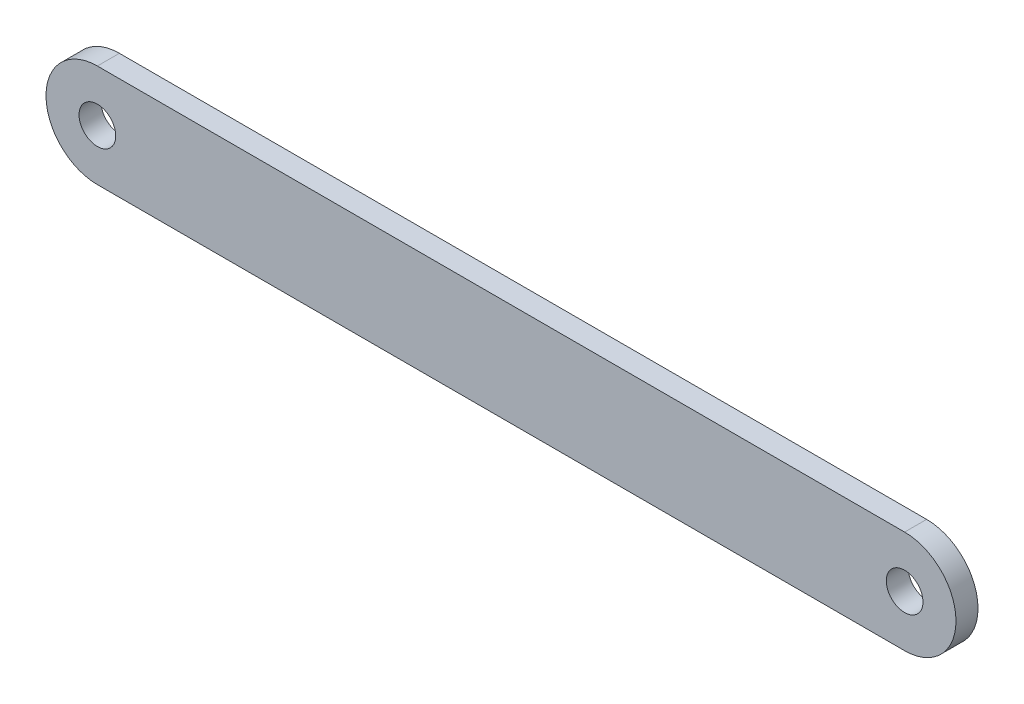
ISO-10303-21;
HEADER;
FILE_DESCRIPTION(('STEP AP214'),'2;1');
FILE_NAME('part.step','',(''),(''),'','','');
FILE_SCHEMA(('AUTOMOTIVE_DESIGN { 1 0 10303 214 1 1 1 1 }'));
ENDSEC;
DATA;
#1=APPLICATION_CONTEXT('core data for automotive mechanical design processes');
#2=APPLICATION_PROTOCOL_DEFINITION('international standard','automotive_design',2000,#1);
#3=PRODUCT_CONTEXT('',#1,'mechanical');
#4=PRODUCT('Part','Part','',(#3));
#5=PRODUCT_RELATED_PRODUCT_CATEGORY('part','',(#4));
#6=PRODUCT_DEFINITION_FORMATION('','',#4);
#7=PRODUCT_DEFINITION_CONTEXT('part definition',#1,'design');
#8=PRODUCT_DEFINITION('design','',#6,#7);
#9=PRODUCT_DEFINITION_SHAPE('','',#8);
#10=(LENGTH_UNIT() NAMED_UNIT(*) SI_UNIT(.MILLI.,.METRE.));
#11=(NAMED_UNIT(*) PLANE_ANGLE_UNIT() SI_UNIT($,.RADIAN.));
#12=(NAMED_UNIT(*) SI_UNIT($,.STERADIAN.) SOLID_ANGLE_UNIT());
#13=UNCERTAINTY_MEASURE_WITH_UNIT(LENGTH_MEASURE(1.E-05),#10,'distance_accuracy_value','');
#14=(GEOMETRIC_REPRESENTATION_CONTEXT(3) GLOBAL_UNCERTAINTY_ASSIGNED_CONTEXT((#13)) GLOBAL_UNIT_ASSIGNED_CONTEXT((#10,
#11,#12)) REPRESENTATION_CONTEXT('',''));
#15=CARTESIAN_POINT('',(0.,0.,0.));
#16=DIRECTION('',(0.,0.,1.));
#17=DIRECTION('',(1.,0.,0.));
#18=AXIS2_PLACEMENT_3D('',#15,#16,#17);
#19=CARTESIAN_POINT('',(-70.9590092991141,262.154117688394,3.));
#20=DIRECTION('',(0.,0.,1.));
#21=DIRECTION('',(1.,0.,0.));
#22=AXIS2_PLACEMENT_3D('',#19,#20,#21);
#23=PLANE('',#22);
#24=CARTESIAN_POINT('',(-70.9590092991141,262.154117688394,3.));
#25=DIRECTION('',(0.,0.,1.));
#26=DIRECTION('',(1.,0.,0.));
#27=AXIS2_PLACEMENT_3D('',#24,#25,#26);
#28=CIRCLE('',#27,2.5);
#29=CARTESIAN_POINT('',(-68.4590092991141,262.154117688394,3.));
#30=VERTEX_POINT('',#29);
#31=EDGE_CURVE('E102',#30,#30,#28,.T.);
#32=ORIENTED_EDGE('',*,*,#31,.F.);
#33=EDGE_LOOP('',(#32));
#34=FACE_BOUND('',#33,.T.);
#35=CARTESIAN_POINT('',(-70.9590092991141,262.154117688394,3.));
#36=DIRECTION('',(0.,0.,1.));
#37=DIRECTION('',(1.,0.,0.));
#38=AXIS2_PLACEMENT_3D('',#35,#36,#37);
#39=CIRCLE('',#38,7.00000000000001);
#40=CARTESIAN_POINT('',(-70.9590092991141,269.154117688394,3.));
#41=VERTEX_POINT('',#40);
#42=CARTESIAN_POINT('',(-70.9590092991141,255.154117688394,3.));
#43=VERTEX_POINT('',#42);
#44=EDGE_CURVE('E87',#41,#43,#39,.T.);
#45=ORIENTED_EDGE('',*,*,#44,.T.);
#46=DIRECTION('',(1.,0.,0.));
#47=VECTOR('',#46,1.);
#48=CARTESIAN_POINT('',(39.0409907008859,255.154117688394,3.));
#49=LINE('',#48,#47);
#50=CARTESIAN_POINT('',(39.0409907008859,255.154117688394,3.));
#51=VERTEX_POINT('',#50);
#52=EDGE_CURVE('E82',#43,#51,#49,.T.);
#53=ORIENTED_EDGE('',*,*,#52,.T.);
#54=CARTESIAN_POINT('',(39.0409907008859,262.154117688394,3.));
#55=DIRECTION('',(0.,0.,1.));
#56=DIRECTION('',(1.,0.,0.));
#57=AXIS2_PLACEMENT_3D('',#54,#55,#56);
#58=CIRCLE('',#57,7.00000000000001);
#59=CARTESIAN_POINT('',(39.0409907008859,269.154117688394,3.));
#60=VERTEX_POINT('',#59);
#61=EDGE_CURVE('E85',#51,#60,#58,.T.);
#62=ORIENTED_EDGE('',*,*,#61,.T.);
#63=DIRECTION('',(-1.,0.,0.));
#64=VECTOR('',#63,1.);
#65=CARTESIAN_POINT('',(-70.9590092991141,269.154117688394,3.));
#66=LINE('',#65,#64);
#67=EDGE_CURVE('E52',#60,#41,#66,.T.);
#68=ORIENTED_EDGE('',*,*,#67,.T.);
#69=EDGE_LOOP('',(#45,#53,#62,#68));
#70=FACE_BOUND('',#69,.T.);
#71=CARTESIAN_POINT('',(39.0409907008859,262.154117688394,3.));
#72=DIRECTION('',(0.,0.,1.));
#73=DIRECTION('',(1.,0.,0.));
#74=AXIS2_PLACEMENT_3D('',#71,#72,#73);
#75=CIRCLE('',#74,2.5);
#76=CARTESIAN_POINT('',(41.5409907008859,262.154117688394,3.));
#77=VERTEX_POINT('',#76);
#78=EDGE_CURVE('E117',#77,#77,#75,.T.);
#79=ORIENTED_EDGE('',*,*,#78,.F.);
#80=EDGE_LOOP('',(#79));
#81=FACE_BOUND('',#80,.T.);
#82=ADVANCED_FACE('F35',(#34,#70,#81),#23,.T.);
#83=CARTESIAN_POINT('',(-70.9590092991141,262.154117688394,0.));
#84=DIRECTION('',(0.,0.,1.));
#85=DIRECTION('',(1.,0.,0.));
#86=AXIS2_PLACEMENT_3D('',#83,#84,#85);
#87=PLANE('',#86);
#88=CARTESIAN_POINT('',(-70.9590092991141,262.154117688394,0.));
#89=DIRECTION('',(0.,0.,1.));
#90=DIRECTION('',(1.,0.,0.));
#91=AXIS2_PLACEMENT_3D('',#88,#89,#90);
#92=CIRCLE('',#91,7.00000000000001);
#93=CARTESIAN_POINT('',(-70.9590092991141,269.154117688394,0.));
#94=VERTEX_POINT('',#93);
#95=CARTESIAN_POINT('',(-70.9590092991141,255.154117688394,0.));
#96=VERTEX_POINT('',#95);
#97=EDGE_CURVE('E99',#94,#96,#92,.T.);
#98=ORIENTED_EDGE('',*,*,#97,.F.);
#99=DIRECTION('',(-1.,0.,0.));
#100=VECTOR('',#99,1.);
#101=CARTESIAN_POINT('',(-70.9590092991141,269.154117688394,0.));
#102=LINE('',#101,#100);
#103=CARTESIAN_POINT('',(39.0409907008859,269.154117688394,0.));
#104=VERTEX_POINT('',#103);
#105=EDGE_CURVE('E75',#104,#94,#102,.T.);
#106=ORIENTED_EDGE('',*,*,#105,.F.);
#107=CARTESIAN_POINT('',(39.0409907008859,262.154117688394,0.));
#108=DIRECTION('',(0.,0.,1.));
#109=DIRECTION('',(1.,0.,0.));
#110=AXIS2_PLACEMENT_3D('',#107,#108,#109);
#111=CIRCLE('',#110,7.00000000000001);
#112=CARTESIAN_POINT('',(39.0409907008859,255.154117688394,0.));
#113=VERTEX_POINT('',#112);
#114=EDGE_CURVE('E69',#113,#104,#111,.T.);
#115=ORIENTED_EDGE('',*,*,#114,.F.);
#116=DIRECTION('',(1.,0.,0.));
#117=VECTOR('',#116,1.);
#118=CARTESIAN_POINT('',(39.0409907008859,255.154117688394,0.));
#119=LINE('',#118,#117);
#120=EDGE_CURVE('E91',#96,#113,#119,.T.);
#121=ORIENTED_EDGE('',*,*,#120,.F.);
#122=EDGE_LOOP('',(#98,#106,#115,#121));
#123=FACE_BOUND('',#122,.T.);
#124=CARTESIAN_POINT('',(-70.9590092991141,262.154117688394,0.));
#125=DIRECTION('',(0.,0.,1.));
#126=DIRECTION('',(1.,0.,0.));
#127=AXIS2_PLACEMENT_3D('',#124,#125,#126);
#128=CIRCLE('',#127,2.5);
#129=CARTESIAN_POINT('',(-68.4590092991141,262.154117688394,0.));
#130=VERTEX_POINT('',#129);
#131=EDGE_CURVE('E114',#130,#130,#128,.T.);
#132=ORIENTED_EDGE('',*,*,#131,.T.);
#133=EDGE_LOOP('',(#132));
#134=FACE_BOUND('',#133,.T.);
#135=CARTESIAN_POINT('',(39.0409907008859,262.154117688394,0.));
#136=DIRECTION('',(0.,0.,1.));
#137=DIRECTION('',(1.,0.,0.));
#138=AXIS2_PLACEMENT_3D('',#135,#136,#137);
#139=CIRCLE('',#138,2.5);
#140=CARTESIAN_POINT('',(41.5409907008859,262.154117688394,0.));
#141=VERTEX_POINT('',#140);
#142=EDGE_CURVE('E120',#141,#141,#139,.T.);
#143=ORIENTED_EDGE('',*,*,#142,.T.);
#144=EDGE_LOOP('',(#143));
#145=FACE_BOUND('',#144,.T.);
#146=ADVANCED_FACE('F110',(#123,#134,#145),#87,.F.);
#147=CARTESIAN_POINT('',(-70.9590092991141,262.154117688394,3.));
#148=DIRECTION('',(0.,0.,-1.));
#149=DIRECTION('',(-1.,0.,0.));
#150=AXIS2_PLACEMENT_3D('',#147,#148,#149);
#151=CYLINDRICAL_SURFACE('',#150,7.00000000000001);
#152=ORIENTED_EDGE('',*,*,#97,.T.);
#153=DIRECTION('',(0.,0.,-1.));
#154=VECTOR('',#153,1.);
#155=CARTESIAN_POINT('',(-70.9590092991141,255.154117688394,3.));
#156=LINE('',#155,#154);
#157=EDGE_CURVE('E11',#43,#96,#156,.T.);
#158=ORIENTED_EDGE('',*,*,#157,.F.);
#159=ORIENTED_EDGE('',*,*,#44,.F.);
#160=DIRECTION('',(0.,0.,-1.));
#161=VECTOR('',#160,1.);
#162=CARTESIAN_POINT('',(-70.9590092991141,269.154117688394,3.));
#163=LINE('',#162,#161);
#164=EDGE_CURVE('E95',#41,#94,#163,.T.);
#165=ORIENTED_EDGE('',*,*,#164,.T.);
#166=EDGE_LOOP('',(#152,#158,#159,#165));
#167=FACE_BOUND('',#166,.T.);
#168=ADVANCED_FACE('F37',(#167),#151,.T.);
#169=CARTESIAN_POINT('',(39.0409907008859,255.154117688394,3.));
#170=DIRECTION('',(0.,1.,0.));
#171=DIRECTION('',(0.,0.,1.));
#172=AXIS2_PLACEMENT_3D('',#169,#170,#171);
#173=PLANE('',#172);
#174=ORIENTED_EDGE('',*,*,#120,.T.);
#175=DIRECTION('',(0.,0.,-1.));
#176=VECTOR('',#175,1.);
#177=CARTESIAN_POINT('',(39.0409907008859,255.154117688394,3.));
#178=LINE('',#177,#176);
#179=EDGE_CURVE('E44',#51,#113,#178,.T.);
#180=ORIENTED_EDGE('',*,*,#179,.F.);
#181=ORIENTED_EDGE('',*,*,#52,.F.);
#182=ORIENTED_EDGE('',*,*,#157,.T.);
#183=EDGE_LOOP('',(#174,#180,#181,#182));
#184=FACE_BOUND('',#183,.T.);
#185=ADVANCED_FACE('F90',(#184),#173,.F.);
#186=CARTESIAN_POINT('',(39.0409907008859,262.154117688394,3.));
#187=DIRECTION('',(0.,0.,-1.));
#188=DIRECTION('',(-1.,0.,0.));
#189=AXIS2_PLACEMENT_3D('',#186,#187,#188);
#190=CYLINDRICAL_SURFACE('',#189,7.00000000000001);
#191=ORIENTED_EDGE('',*,*,#114,.T.);
#192=DIRECTION('',(0.,0.,-1.));
#193=VECTOR('',#192,1.);
#194=CARTESIAN_POINT('',(39.0409907008859,269.154117688394,3.));
#195=LINE('',#194,#193);
#196=EDGE_CURVE('E92',#60,#104,#195,.T.);
#197=ORIENTED_EDGE('',*,*,#196,.F.);
#198=ORIENTED_EDGE('',*,*,#61,.F.);
#199=ORIENTED_EDGE('',*,*,#179,.T.);
#200=EDGE_LOOP('',(#191,#197,#198,#199));
#201=FACE_BOUND('',#200,.T.);
#202=ADVANCED_FACE('F93',(#201),#190,.T.);
#203=CARTESIAN_POINT('',(-70.9590092991141,269.154117688394,3.));
#204=DIRECTION('',(0.,-1.,0.));
#205=DIRECTION('',(0.,0.,-1.));
#206=AXIS2_PLACEMENT_3D('',#203,#204,#205);
#207=PLANE('',#206);
#208=ORIENTED_EDGE('',*,*,#105,.T.);
#209=ORIENTED_EDGE('',*,*,#164,.F.);
#210=ORIENTED_EDGE('',*,*,#67,.F.);
#211=ORIENTED_EDGE('',*,*,#196,.T.);
#212=EDGE_LOOP('',(#208,#209,#210,#211));
#213=FACE_BOUND('',#212,.T.);
#214=ADVANCED_FACE('F107',(#213),#207,.F.);
#215=CARTESIAN_POINT('',(-70.9590092991141,262.154117688394,3.));
#216=DIRECTION('',(0.,0.,-1.));
#217=DIRECTION('',(-1.,0.,0.));
#218=AXIS2_PLACEMENT_3D('',#215,#216,#217);
#219=CYLINDRICAL_SURFACE('',#218,2.5);
#220=ORIENTED_EDGE('',*,*,#31,.T.);
#221=EDGE_LOOP('',(#220));
#222=FACE_BOUND('',#221,.T.);
#223=ORIENTED_EDGE('',*,*,#131,.F.);
#224=EDGE_LOOP('',(#223));
#225=FACE_BOUND('',#224,.T.);
#226=ADVANCED_FACE('F137',(#222,#225),#219,.F.);
#227=CARTESIAN_POINT('',(39.0409907008859,262.154117688394,3.));
#228=DIRECTION('',(0.,0.,-1.));
#229=DIRECTION('',(-1.,0.,0.));
#230=AXIS2_PLACEMENT_3D('',#227,#228,#229);
#231=CYLINDRICAL_SURFACE('',#230,2.5);
#232=ORIENTED_EDGE('',*,*,#78,.T.);
#233=EDGE_LOOP('',(#232));
#234=FACE_BOUND('',#233,.T.);
#235=ORIENTED_EDGE('',*,*,#142,.F.);
#236=EDGE_LOOP('',(#235));
#237=FACE_BOUND('',#236,.T.);
#238=ADVANCED_FACE('F126',(#234,#237),#231,.F.);
#239=CLOSED_SHELL('',(#82,#146,#168,#185,#202,#214,#226,#238));
#240=MANIFOLD_SOLID_BREP('B2',#239);
#241=ADVANCED_BREP_SHAPE_REPRESENTATION('',(#18,#240),#14);
#242=SHAPE_DEFINITION_REPRESENTATION(#9,#241);
ENDSEC;
END-ISO-10303-21;
